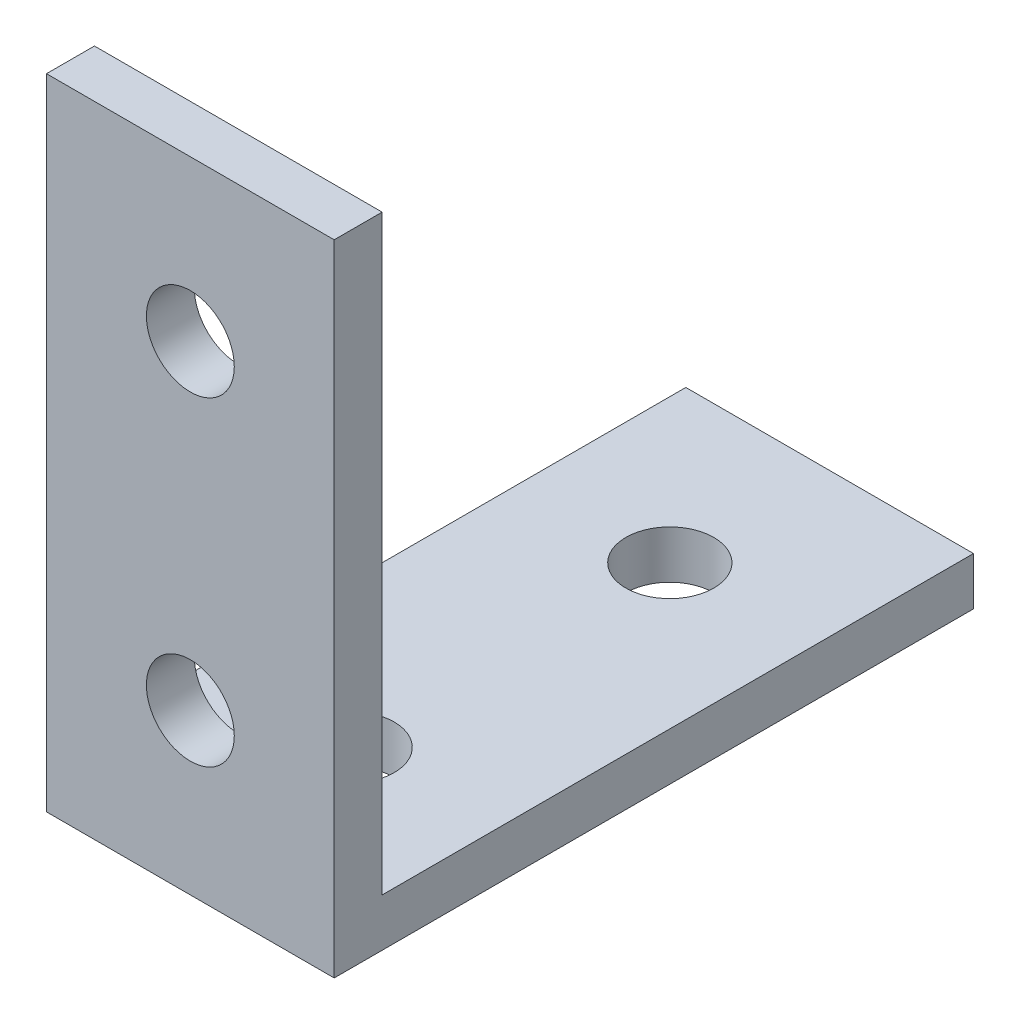
ISO-10303-21;
HEADER;
FILE_DESCRIPTION(('STEP AP214'),'2;1');
FILE_NAME('part.step','',(''),(''),'','','');
FILE_SCHEMA(('AUTOMOTIVE_DESIGN { 1 0 10303 214 1 1 1 1 }'));
ENDSEC;
DATA;
#1=APPLICATION_CONTEXT('core data for automotive mechanical design processes');
#2=APPLICATION_PROTOCOL_DEFINITION('international standard','automotive_design',2000,#1);
#3=PRODUCT_CONTEXT('',#1,'mechanical');
#4=PRODUCT('Part','Part','',(#3));
#5=PRODUCT_RELATED_PRODUCT_CATEGORY('part','',(#4));
#6=PRODUCT_DEFINITION_FORMATION('','',#4);
#7=PRODUCT_DEFINITION_CONTEXT('part definition',#1,'design');
#8=PRODUCT_DEFINITION('design','',#6,#7);
#9=PRODUCT_DEFINITION_SHAPE('','',#8);
#10=(LENGTH_UNIT() NAMED_UNIT(*) SI_UNIT(.MILLI.,.METRE.));
#11=(NAMED_UNIT(*) PLANE_ANGLE_UNIT() SI_UNIT($,.RADIAN.));
#12=(NAMED_UNIT(*) SI_UNIT($,.STERADIAN.) SOLID_ANGLE_UNIT());
#13=UNCERTAINTY_MEASURE_WITH_UNIT(LENGTH_MEASURE(1.E-05),#10,'distance_accuracy_value','');
#14=(GEOMETRIC_REPRESENTATION_CONTEXT(3) GLOBAL_UNCERTAINTY_ASSIGNED_CONTEXT((#13)) GLOBAL_UNIT_ASSIGNED_CONTEXT((#10,
#11,#12)) REPRESENTATION_CONTEXT('',''));
#15=CARTESIAN_POINT('',(0.,0.,0.));
#16=DIRECTION('',(0.,0.,1.));
#17=DIRECTION('',(1.,0.,0.));
#18=AXIS2_PLACEMENT_3D('',#15,#16,#17);
#19=CARTESIAN_POINT('',(18.,0.,-3.));
#20=DIRECTION('',(0.,-1.,0.));
#21=DIRECTION('',(0.,0.,-1.));
#22=AXIS2_PLACEMENT_3D('',#19,#20,#21);
#23=PLANE('',#22);
#24=DIRECTION('',(0.,0.,1.));
#25=VECTOR('',#24,1.);
#26=CARTESIAN_POINT('',(0.,0.,-3.));
#27=LINE('',#26,#25);
#28=CARTESIAN_POINT('',(0.,0.,-3.));
#29=VERTEX_POINT('',#28);
#30=CARTESIAN_POINT('',(0.,0.,0.));
#31=VERTEX_POINT('',#30);
#32=EDGE_CURVE('E120',#29,#31,#27,.T.);
#33=ORIENTED_EDGE('',*,*,#32,.T.);
#34=DIRECTION('',(-1.,0.,0.));
#35=VECTOR('',#34,1.);
#36=CARTESIAN_POINT('',(18.,0.,0.));
#37=LINE('',#36,#35);
#38=CARTESIAN_POINT('',(18.,0.,0.));
#39=VERTEX_POINT('',#38);
#40=EDGE_CURVE('E11',#39,#31,#37,.T.);
#41=ORIENTED_EDGE('',*,*,#40,.F.);
#42=DIRECTION('',(0.,0.,1.));
#43=VECTOR('',#42,1.);
#44=CARTESIAN_POINT('',(18.,0.,-3.));
#45=LINE('',#44,#43);
#46=CARTESIAN_POINT('',(18.,0.,-3.));
#47=VERTEX_POINT('',#46);
#48=EDGE_CURVE('E131',#47,#39,#45,.T.);
#49=ORIENTED_EDGE('',*,*,#48,.F.);
#50=DIRECTION('',(-1.,0.,0.));
#51=VECTOR('',#50,1.);
#52=CARTESIAN_POINT('',(18.,0.,-3.));
#53=LINE('',#52,#51);
#54=EDGE_CURVE('E116',#47,#29,#53,.T.);
#55=ORIENTED_EDGE('',*,*,#54,.T.);
#56=EDGE_LOOP('',(#33,#41,#49,#55));
#57=FACE_BOUND('',#56,.T.);
#58=ADVANCED_FACE('F34',(#57),#23,.F.);
#59=CARTESIAN_POINT('',(18.,0.,0.));
#60=DIRECTION('',(0.,0.,-1.));
#61=DIRECTION('',(0.,1.,0.));
#62=AXIS2_PLACEMENT_3D('',#59,#60,#61);
#63=PLANE('',#62);
#64=CARTESIAN_POINT('',(9.,-10.,0.));
#65=DIRECTION('',(0.,0.,1.));
#66=DIRECTION('',(1.,0.,0.));
#67=AXIS2_PLACEMENT_3D('',#64,#65,#66);
#68=CIRCLE('',#67,2.75);
#69=CARTESIAN_POINT('',(11.75,-10.,0.));
#70=VERTEX_POINT('',#69);
#71=EDGE_CURVE('E145',#70,#70,#68,.T.);
#72=ORIENTED_EDGE('',*,*,#71,.F.);
#73=EDGE_LOOP('',(#72));
#74=FACE_BOUND('',#73,.T.);
#75=CARTESIAN_POINT('',(9.00000000000001,-30.,0.));
#76=DIRECTION('',(0.,0.,1.));
#77=DIRECTION('',(1.,0.,0.));
#78=AXIS2_PLACEMENT_3D('',#75,#76,#77);
#79=CIRCLE('',#78,2.75);
#80=CARTESIAN_POINT('',(11.75,-30.,0.));
#81=VERTEX_POINT('',#80);
#82=EDGE_CURVE('E150',#81,#81,#79,.T.);
#83=ORIENTED_EDGE('',*,*,#82,.F.);
#84=EDGE_LOOP('',(#83));
#85=FACE_BOUND('',#84,.T.);
#86=DIRECTION('',(0.,-1.,0.));
#87=VECTOR('',#86,1.);
#88=CARTESIAN_POINT('',(0.,0.,0.));
#89=LINE('',#88,#87);
#90=CARTESIAN_POINT('',(0.,-40.,0.));
#91=VERTEX_POINT('',#90);
#92=EDGE_CURVE('E123',#31,#91,#89,.T.);
#93=ORIENTED_EDGE('',*,*,#92,.T.);
#94=DIRECTION('',(-1.,0.,0.));
#95=VECTOR('',#94,1.);
#96=CARTESIAN_POINT('',(18.,-40.,0.));
#97=LINE('',#96,#95);
#98=CARTESIAN_POINT('',(18.,-40.,0.));
#99=VERTEX_POINT('',#98);
#100=EDGE_CURVE('E43',#99,#91,#97,.T.);
#101=ORIENTED_EDGE('',*,*,#100,.F.);
#102=DIRECTION('',(0.,-1.,0.));
#103=VECTOR('',#102,1.);
#104=CARTESIAN_POINT('',(18.,0.,0.));
#105=LINE('',#104,#103);
#106=EDGE_CURVE('E89',#39,#99,#105,.T.);
#107=ORIENTED_EDGE('',*,*,#106,.F.);
#108=ORIENTED_EDGE('',*,*,#40,.T.);
#109=EDGE_LOOP('',(#93,#101,#107,#108));
#110=FACE_BOUND('',#109,.T.);
#111=ADVANCED_FACE('F163',(#74,#85,#110),#63,.F.);
#112=CARTESIAN_POINT('',(18.,-40.,0.));
#113=DIRECTION('',(0.,1.,0.));
#114=DIRECTION('',(0.,0.,1.));
#115=AXIS2_PLACEMENT_3D('',#112,#113,#114);
#116=PLANE('',#115);
#117=CARTESIAN_POINT('',(9.,-40.,-10.));
#118=DIRECTION('',(0.,1.,0.));
#119=DIRECTION('',(0.,0.,1.));
#120=AXIS2_PLACEMENT_3D('',#117,#118,#119);
#121=CIRCLE('',#120,2.75);
#122=CARTESIAN_POINT('',(9.,-40.,-7.25));
#123=VERTEX_POINT('',#122);
#124=EDGE_CURVE('E124',#123,#123,#121,.T.);
#125=ORIENTED_EDGE('',*,*,#124,.T.);
#126=EDGE_LOOP('',(#125));
#127=FACE_BOUND('',#126,.T.);
#128=CARTESIAN_POINT('',(9.,-40.,-30.));
#129=DIRECTION('',(0.,1.,0.));
#130=DIRECTION('',(0.,0.,1.));
#131=AXIS2_PLACEMENT_3D('',#128,#129,#130);
#132=CIRCLE('',#131,2.75);
#133=CARTESIAN_POINT('',(9.,-40.,-27.25));
#134=VERTEX_POINT('',#133);
#135=EDGE_CURVE('E138',#134,#134,#132,.T.);
#136=ORIENTED_EDGE('',*,*,#135,.T.);
#137=EDGE_LOOP('',(#136));
#138=FACE_BOUND('',#137,.T.);
#139=DIRECTION('',(0.,0.,-1.));
#140=VECTOR('',#139,1.);
#141=CARTESIAN_POINT('',(0.,-40.,0.));
#142=LINE('',#141,#140);
#143=CARTESIAN_POINT('',(0.,-40.,-40.));
#144=VERTEX_POINT('',#143);
#145=EDGE_CURVE('E126',#91,#144,#142,.T.);
#146=ORIENTED_EDGE('',*,*,#145,.T.);
#147=DIRECTION('',(-1.,0.,0.));
#148=VECTOR('',#147,1.);
#149=CARTESIAN_POINT('',(18.,-40.,-40.));
#150=LINE('',#149,#148);
#151=CARTESIAN_POINT('',(18.,-40.,-40.));
#152=VERTEX_POINT('',#151);
#153=EDGE_CURVE('E111',#152,#144,#150,.T.);
#154=ORIENTED_EDGE('',*,*,#153,.F.);
#155=DIRECTION('',(0.,0.,-1.));
#156=VECTOR('',#155,1.);
#157=CARTESIAN_POINT('',(18.,-40.,0.));
#158=LINE('',#157,#156);
#159=EDGE_CURVE('E102',#99,#152,#158,.T.);
#160=ORIENTED_EDGE('',*,*,#159,.F.);
#161=ORIENTED_EDGE('',*,*,#100,.T.);
#162=EDGE_LOOP('',(#146,#154,#160,#161));
#163=FACE_BOUND('',#162,.T.);
#164=ADVANCED_FACE('F166',(#127,#138,#163),#116,.F.);
#165=CARTESIAN_POINT('',(18.,-40.,-40.));
#166=DIRECTION('',(0.,0.,1.));
#167=DIRECTION('',(1.,0.,0.));
#168=AXIS2_PLACEMENT_3D('',#165,#166,#167);
#169=PLANE('',#168);
#170=DIRECTION('',(0.,1.,0.));
#171=VECTOR('',#170,1.);
#172=CARTESIAN_POINT('',(0.,-40.,-40.));
#173=LINE('',#172,#171);
#174=CARTESIAN_POINT('',(0.,-37.,-40.));
#175=VERTEX_POINT('',#174);
#176=EDGE_CURVE('E110',#144,#175,#173,.T.);
#177=ORIENTED_EDGE('',*,*,#176,.T.);
#178=DIRECTION('',(-1.,0.,0.));
#179=VECTOR('',#178,1.);
#180=CARTESIAN_POINT('',(18.,-37.,-40.));
#181=LINE('',#180,#179);
#182=CARTESIAN_POINT('',(18.,-37.,-40.));
#183=VERTEX_POINT('',#182);
#184=EDGE_CURVE('E107',#183,#175,#181,.T.);
#185=ORIENTED_EDGE('',*,*,#184,.F.);
#186=DIRECTION('',(0.,1.,0.));
#187=VECTOR('',#186,1.);
#188=CARTESIAN_POINT('',(18.,-40.,-40.));
#189=LINE('',#188,#187);
#190=EDGE_CURVE('E96',#152,#183,#189,.T.);
#191=ORIENTED_EDGE('',*,*,#190,.F.);
#192=ORIENTED_EDGE('',*,*,#153,.T.);
#193=EDGE_LOOP('',(#177,#185,#191,#192));
#194=FACE_BOUND('',#193,.T.);
#195=ADVANCED_FACE('F108',(#194),#169,.F.);
#196=CARTESIAN_POINT('',(18.,-37.,-40.));
#197=DIRECTION('',(0.,-1.,0.));
#198=DIRECTION('',(0.,0.,-1.));
#199=AXIS2_PLACEMENT_3D('',#196,#197,#198);
#200=PLANE('',#199);
#201=CARTESIAN_POINT('',(9.,-37.,-10.));
#202=DIRECTION('',(0.,-1.,0.));
#203=DIRECTION('',(0.,0.,-1.));
#204=AXIS2_PLACEMENT_3D('',#201,#202,#203);
#205=CIRCLE('',#204,2.75);
#206=CARTESIAN_POINT('',(9.,-37.,-12.75));
#207=VERTEX_POINT('',#206);
#208=EDGE_CURVE('E37',#207,#207,#205,.T.);
#209=ORIENTED_EDGE('',*,*,#208,.T.);
#210=EDGE_LOOP('',(#209));
#211=FACE_BOUND('',#210,.T.);
#212=CARTESIAN_POINT('',(9.,-37.,-30.));
#213=DIRECTION('',(0.,-1.,0.));
#214=DIRECTION('',(0.,0.,-1.));
#215=AXIS2_PLACEMENT_3D('',#212,#213,#214);
#216=CIRCLE('',#215,2.75);
#217=CARTESIAN_POINT('',(9.,-37.,-32.75));
#218=VERTEX_POINT('',#217);
#219=EDGE_CURVE('E136',#218,#218,#216,.T.);
#220=ORIENTED_EDGE('',*,*,#219,.T.);
#221=EDGE_LOOP('',(#220));
#222=FACE_BOUND('',#221,.T.);
#223=DIRECTION('',(0.,0.,1.));
#224=VECTOR('',#223,1.);
#225=CARTESIAN_POINT('',(0.,-37.,-40.));
#226=LINE('',#225,#224);
#227=CARTESIAN_POINT('',(0.,-37.,-3.));
#228=VERTEX_POINT('',#227);
#229=EDGE_CURVE('E75',#175,#228,#226,.T.);
#230=ORIENTED_EDGE('',*,*,#229,.T.);
#231=DIRECTION('',(-1.,0.,0.));
#232=VECTOR('',#231,1.);
#233=CARTESIAN_POINT('',(18.,-37.,-3.));
#234=LINE('',#233,#232);
#235=CARTESIAN_POINT('',(18.,-37.,-3.));
#236=VERTEX_POINT('',#235);
#237=EDGE_CURVE('E112',#236,#228,#234,.T.);
#238=ORIENTED_EDGE('',*,*,#237,.F.);
#239=DIRECTION('',(0.,0.,1.));
#240=VECTOR('',#239,1.);
#241=CARTESIAN_POINT('',(18.,-37.,-40.));
#242=LINE('',#241,#240);
#243=EDGE_CURVE('E100',#183,#236,#242,.T.);
#244=ORIENTED_EDGE('',*,*,#243,.F.);
#245=ORIENTED_EDGE('',*,*,#184,.T.);
#246=EDGE_LOOP('',(#230,#238,#244,#245));
#247=FACE_BOUND('',#246,.T.);
#248=ADVANCED_FACE('F114',(#211,#222,#247),#200,.F.);
#249=CARTESIAN_POINT('',(18.,-37.,-3.));
#250=DIRECTION('',(0.,0.,1.));
#251=DIRECTION('',(0.,-1.,0.));
#252=AXIS2_PLACEMENT_3D('',#249,#250,#251);
#253=PLANE('',#252);
#254=CARTESIAN_POINT('',(9.,-10.,-3.));
#255=DIRECTION('',(0.,0.,1.));
#256=DIRECTION('',(0.,-1.,0.));
#257=AXIS2_PLACEMENT_3D('',#254,#255,#256);
#258=CIRCLE('',#257,2.75);
#259=CARTESIAN_POINT('',(9.,-12.75,-3.));
#260=VERTEX_POINT('',#259);
#261=EDGE_CURVE('E139',#260,#260,#258,.F.);
#262=ORIENTED_EDGE('',*,*,#261,.F.);
#263=EDGE_LOOP('',(#262));
#264=FACE_BOUND('',#263,.T.);
#265=CARTESIAN_POINT('',(9.00000000000001,-30.,-3.));
#266=DIRECTION('',(0.,0.,1.));
#267=DIRECTION('',(0.,-1.,0.));
#268=AXIS2_PLACEMENT_3D('',#265,#266,#267);
#269=CIRCLE('',#268,2.75);
#270=CARTESIAN_POINT('',(9.00000000000001,-32.75,-3.));
#271=VERTEX_POINT('',#270);
#272=EDGE_CURVE('E153',#271,#271,#269,.F.);
#273=ORIENTED_EDGE('',*,*,#272,.F.);
#274=EDGE_LOOP('',(#273));
#275=FACE_BOUND('',#274,.T.);
#276=DIRECTION('',(0.,1.,0.));
#277=VECTOR('',#276,1.);
#278=CARTESIAN_POINT('',(0.,-37.,-3.));
#279=LINE('',#278,#277);
#280=EDGE_CURVE('E81',#228,#29,#279,.T.);
#281=ORIENTED_EDGE('',*,*,#280,.T.);
#282=ORIENTED_EDGE('',*,*,#54,.F.);
#283=DIRECTION('',(0.,1.,0.));
#284=VECTOR('',#283,1.);
#285=CARTESIAN_POINT('',(18.,-37.,-3.));
#286=LINE('',#285,#284);
#287=EDGE_CURVE('E52',#236,#47,#286,.T.);
#288=ORIENTED_EDGE('',*,*,#287,.F.);
#289=ORIENTED_EDGE('',*,*,#237,.T.);
#290=EDGE_LOOP('',(#281,#282,#288,#289));
#291=FACE_BOUND('',#290,.T.);
#292=ADVANCED_FACE('F171',(#264,#275,#291),#253,.F.);
#293=CARTESIAN_POINT('',(18.,0.,0.));
#294=DIRECTION('',(1.,0.,0.));
#295=DIRECTION('',(0.,0.,-1.));
#296=AXIS2_PLACEMENT_3D('',#293,#294,#295);
#297=PLANE('',#296);
#298=ORIENTED_EDGE('',*,*,#48,.T.);
#299=ORIENTED_EDGE('',*,*,#106,.T.);
#300=ORIENTED_EDGE('',*,*,#159,.T.);
#301=ORIENTED_EDGE('',*,*,#190,.T.);
#302=ORIENTED_EDGE('',*,*,#243,.T.);
#303=ORIENTED_EDGE('',*,*,#287,.T.);
#304=EDGE_LOOP('',(#298,#299,#300,#301,#302,#303));
#305=FACE_BOUND('',#304,.T.);
#306=ADVANCED_FACE('F98',(#305),#297,.T.);
#307=CARTESIAN_POINT('',(0.,0.,0.));
#308=DIRECTION('',(1.,0.,0.));
#309=DIRECTION('',(0.,0.,-1.));
#310=AXIS2_PLACEMENT_3D('',#307,#308,#309);
#311=PLANE('',#310);
#312=ORIENTED_EDGE('',*,*,#32,.F.);
#313=ORIENTED_EDGE('',*,*,#280,.F.);
#314=ORIENTED_EDGE('',*,*,#229,.F.);
#315=ORIENTED_EDGE('',*,*,#176,.F.);
#316=ORIENTED_EDGE('',*,*,#145,.F.);
#317=ORIENTED_EDGE('',*,*,#92,.F.);
#318=EDGE_LOOP('',(#312,#313,#314,#315,#316,#317));
#319=FACE_BOUND('',#318,.T.);
#320=ADVANCED_FACE('F169',(#319),#311,.F.);
#321=CARTESIAN_POINT('',(9.,0.,-30.));
#322=DIRECTION('',(0.,-1.,0.));
#323=DIRECTION('',(0.,0.,-1.));
#324=AXIS2_PLACEMENT_3D('',#321,#322,#323);
#325=CYLINDRICAL_SURFACE('',#324,2.75);
#326=ORIENTED_EDGE('',*,*,#219,.F.);
#327=EDGE_LOOP('',(#326));
#328=FACE_BOUND('',#327,.T.);
#329=ORIENTED_EDGE('',*,*,#135,.F.);
#330=EDGE_LOOP('',(#329));
#331=FACE_BOUND('',#330,.T.);
#332=ADVANCED_FACE('F216',(#328,#331),#325,.F.);
#333=CARTESIAN_POINT('',(9.,0.,-10.));
#334=DIRECTION('',(0.,-1.,0.));
#335=DIRECTION('',(0.,0.,-1.));
#336=AXIS2_PLACEMENT_3D('',#333,#334,#335);
#337=CYLINDRICAL_SURFACE('',#336,2.75);
#338=ORIENTED_EDGE('',*,*,#208,.F.);
#339=EDGE_LOOP('',(#338));
#340=FACE_BOUND('',#339,.T.);
#341=ORIENTED_EDGE('',*,*,#124,.F.);
#342=EDGE_LOOP('',(#341));
#343=FACE_BOUND('',#342,.T.);
#344=ADVANCED_FACE('F221',(#340,#343),#337,.F.);
#345=CARTESIAN_POINT('',(9.00000000000001,-30.,-40.001));
#346=DIRECTION('',(0.,0.,1.));
#347=DIRECTION('',(1.,0.,0.));
#348=AXIS2_PLACEMENT_3D('',#345,#346,#347);
#349=CYLINDRICAL_SURFACE('',#348,2.75);
#350=ORIENTED_EDGE('',*,*,#82,.T.);
#351=EDGE_LOOP('',(#350));
#352=FACE_BOUND('',#351,.T.);
#353=ORIENTED_EDGE('',*,*,#272,.T.);
#354=EDGE_LOOP('',(#353));
#355=FACE_BOUND('',#354,.T.);
#356=ADVANCED_FACE('F232',(#352,#355),#349,.F.);
#357=CARTESIAN_POINT('',(9.,-10.,-40.001));
#358=DIRECTION('',(0.,0.,1.));
#359=DIRECTION('',(1.,0.,0.));
#360=AXIS2_PLACEMENT_3D('',#357,#358,#359);
#361=CYLINDRICAL_SURFACE('',#360,2.75);
#362=ORIENTED_EDGE('',*,*,#71,.T.);
#363=EDGE_LOOP('',(#362));
#364=FACE_BOUND('',#363,.T.);
#365=ORIENTED_EDGE('',*,*,#261,.T.);
#366=EDGE_LOOP('',(#365));
#367=FACE_BOUND('',#366,.T.);
#368=ADVANCED_FACE('F252',(#364,#367),#361,.F.);
#369=CLOSED_SHELL('',(#58,#111,#164,#195,#248,#292,#306,#320,#332,#344,#356,#368));
#370=MANIFOLD_SOLID_BREP('B2',#369);
#371=ADVANCED_BREP_SHAPE_REPRESENTATION('',(#18,#370),#14);
#372=SHAPE_DEFINITION_REPRESENTATION(#9,#371);
ENDSEC;
END-ISO-10303-21;
